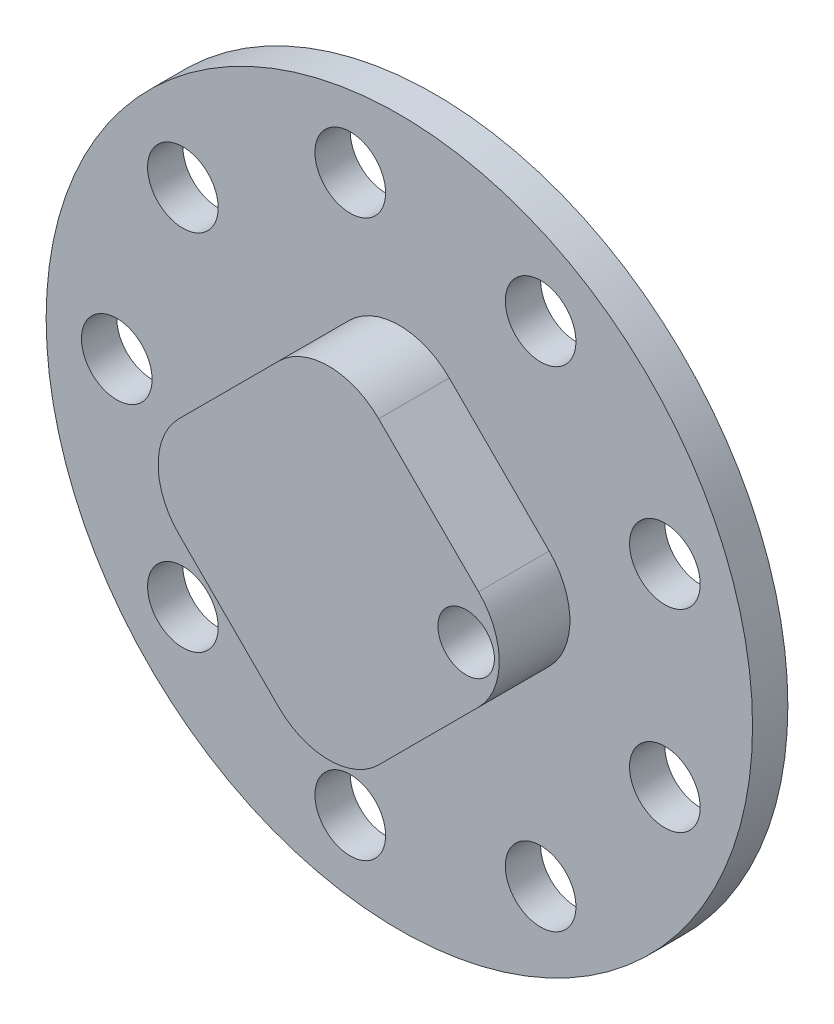
ISO-10303-21;
HEADER;
FILE_DESCRIPTION(('STEP AP214'),'2;1');
FILE_NAME('part.step','',(''),(''),'','','');
FILE_SCHEMA(('AUTOMOTIVE_DESIGN { 1 0 10303 214 1 1 1 1 }'));
ENDSEC;
DATA;
#1=APPLICATION_CONTEXT('core data for automotive mechanical design processes');
#2=APPLICATION_PROTOCOL_DEFINITION('international standard','automotive_design',2000,#1);
#3=PRODUCT_CONTEXT('',#1,'mechanical');
#4=PRODUCT('Part','Part','',(#3));
#5=PRODUCT_RELATED_PRODUCT_CATEGORY('part','',(#4));
#6=PRODUCT_DEFINITION_FORMATION('','',#4);
#7=PRODUCT_DEFINITION_CONTEXT('part definition',#1,'design');
#8=PRODUCT_DEFINITION('design','',#6,#7);
#9=PRODUCT_DEFINITION_SHAPE('','',#8);
#10=(LENGTH_UNIT() NAMED_UNIT(*) SI_UNIT(.MILLI.,.METRE.));
#11=(NAMED_UNIT(*) PLANE_ANGLE_UNIT() SI_UNIT($,.RADIAN.));
#12=(NAMED_UNIT(*) SI_UNIT($,.STERADIAN.) SOLID_ANGLE_UNIT());
#13=UNCERTAINTY_MEASURE_WITH_UNIT(LENGTH_MEASURE(1.E-05),#10,'distance_accuracy_value','');
#14=(GEOMETRIC_REPRESENTATION_CONTEXT(3) GLOBAL_UNCERTAINTY_ASSIGNED_CONTEXT((#13)) GLOBAL_UNIT_ASSIGNED_CONTEXT((#10,
#11,#12)) REPRESENTATION_CONTEXT('',''));
#15=CARTESIAN_POINT('',(0.,0.,0.));
#16=DIRECTION('',(0.,0.,1.));
#17=DIRECTION('',(1.,0.,0.));
#18=AXIS2_PLACEMENT_3D('',#15,#16,#17);
#19=CARTESIAN_POINT('',(0.,0.,5.));
#20=DIRECTION('',(0.,0.,1.));
#21=DIRECTION('',(1.,0.,0.));
#22=AXIS2_PLACEMENT_3D('',#19,#20,#21);
#23=PLANE('',#22);
#24=CARTESIAN_POINT('',(0.,0.,5.));
#25=DIRECTION('',(0.,0.,1.));
#26=DIRECTION('',(1.,0.,0.));
#27=AXIS2_PLACEMENT_3D('',#24,#25,#26);
#28=CIRCLE('',#27,50.);
#29=CARTESIAN_POINT('',(50.,0.,5.));
#30=VERTEX_POINT('',#29);
#31=EDGE_CURVE('E199',#30,#30,#28,.T.);
#32=ORIENTED_EDGE('',*,*,#31,.T.);
#33=EDGE_LOOP('',(#32));
#34=FACE_BOUND('',#33,.T.);
#35=CARTESIAN_POINT('',(-40.,0.,5.));
#36=DIRECTION('',(0.,0.,1.));
#37=DIRECTION('',(1.,0.,0.));
#38=AXIS2_PLACEMENT_3D('',#35,#36,#37);
#39=CIRCLE('',#38,5.);
#40=CARTESIAN_POINT('',(-35.,0.,5.));
#41=VERTEX_POINT('',#40);
#42=EDGE_CURVE('E190',#41,#41,#39,.T.);
#43=ORIENTED_EDGE('',*,*,#42,.F.);
#44=EDGE_LOOP('',(#43));
#45=FACE_BOUND('',#44,.T.);
#46=CARTESIAN_POINT('',(-30.6417777247591,25.7115043874616,5.));
#47=DIRECTION('',(0.,0.,1.));
#48=DIRECTION('',(0.766044443118977,-0.642787609686541,0.));
#49=AXIS2_PLACEMENT_3D('',#46,#47,#48);
#50=CIRCLE('',#49,5.);
#51=CARTESIAN_POINT('',(-26.8115555091642,22.4975663390289,5.));
#52=VERTEX_POINT('',#51);
#53=EDGE_CURVE('E184',#52,#52,#50,.T.);
#54=ORIENTED_EDGE('',*,*,#53,.F.);
#55=EDGE_LOOP('',(#54));
#56=FACE_BOUND('',#55,.T.);
#57=CARTESIAN_POINT('',(-6.94592710667709,39.3923101204883,5.));
#58=DIRECTION('',(0.,0.,1.));
#59=DIRECTION('',(0.173648177666927,-0.984807753012209,0.));
#60=AXIS2_PLACEMENT_3D('',#57,#58,#59);
#61=CIRCLE('',#60,5.);
#62=CARTESIAN_POINT('',(-6.07768621834246,34.4682713554273,5.));
#63=VERTEX_POINT('',#62);
#64=EDGE_CURVE('E178',#63,#63,#61,.T.);
#65=ORIENTED_EDGE('',*,*,#64,.F.);
#66=EDGE_LOOP('',(#65));
#67=FACE_BOUND('',#66,.T.);
#68=CARTESIAN_POINT('',(20.0000000000002,34.6410161513775,5.));
#69=DIRECTION('',(0.,0.,1.));
#70=DIRECTION('',(-0.500000000000004,-0.866025403784436,0.));
#71=AXIS2_PLACEMENT_3D('',#68,#69,#70);
#72=CIRCLE('',#71,5.);
#73=CARTESIAN_POINT('',(17.5000000000001,30.3108891324553,5.));
#74=VERTEX_POINT('',#73);
#75=EDGE_CURVE('E172',#74,#74,#72,.T.);
#76=ORIENTED_EDGE('',*,*,#75,.F.);
#77=EDGE_LOOP('',(#76));
#78=FACE_BOUND('',#77,.T.);
#79=CARTESIAN_POINT('',(37.5877048314364,13.6808057330265,5.));
#80=DIRECTION('',(0.,0.,1.));
#81=DIRECTION('',(-0.939692620785911,-0.342020143325663,0.));
#82=AXIS2_PLACEMENT_3D('',#79,#80,#81);
#83=CIRCLE('',#82,5.);
#84=CARTESIAN_POINT('',(32.8892417275069,11.9707050163982,5.));
#85=VERTEX_POINT('',#84);
#86=EDGE_CURVE('E166',#85,#85,#83,.T.);
#87=ORIENTED_EDGE('',*,*,#86,.F.);
#88=EDGE_LOOP('',(#87));
#89=FACE_BOUND('',#88,.T.);
#90=CARTESIAN_POINT('',(37.5877048314362,-13.680805733027,5.));
#91=DIRECTION('',(0.,0.,1.));
#92=DIRECTION('',(-0.939692620785906,0.342020143325676,0.));
#93=AXIS2_PLACEMENT_3D('',#90,#91,#92);
#94=CIRCLE('',#93,5.);
#95=CARTESIAN_POINT('',(32.8892417275067,-11.9707050163987,5.));
#96=VERTEX_POINT('',#95);
#97=EDGE_CURVE('E160',#96,#96,#94,.T.);
#98=ORIENTED_EDGE('',*,*,#97,.F.);
#99=EDGE_LOOP('',(#98));
#100=FACE_BOUND('',#99,.T.);
#101=CARTESIAN_POINT('',(19.9999999999997,-34.6410161513777,5.));
#102=DIRECTION('',(0.,0.,1.));
#103=DIRECTION('',(-0.499999999999992,0.866025403784443,0.));
#104=AXIS2_PLACEMENT_3D('',#101,#102,#103);
#105=CIRCLE('',#104,5.);
#106=CARTESIAN_POINT('',(17.4999999999997,-30.3108891324555,5.));
#107=VERTEX_POINT('',#106);
#108=EDGE_CURVE('E154',#107,#107,#105,.T.);
#109=ORIENTED_EDGE('',*,*,#108,.F.);
#110=EDGE_LOOP('',(#109));
#111=FACE_BOUND('',#110,.T.);
#112=CARTESIAN_POINT('',(-6.94592710667762,-39.3923101204883,5.));
#113=DIRECTION('',(0.,0.,1.));
#114=DIRECTION('',(0.17364817766694,0.984807753012206,0.));
#115=AXIS2_PLACEMENT_3D('',#112,#113,#114);
#116=CIRCLE('',#115,5.);
#117=CARTESIAN_POINT('',(-6.07768621834292,-34.4682713554272,5.));
#118=VERTEX_POINT('',#117);
#119=EDGE_CURVE('E148',#118,#118,#116,.T.);
#120=ORIENTED_EDGE('',*,*,#119,.F.);
#121=EDGE_LOOP('',(#120));
#122=FACE_BOUND('',#121,.T.);
#123=CARTESIAN_POINT('',(-30.6417777247594,-25.7115043874612,5.));
#124=DIRECTION('',(0.,0.,1.));
#125=DIRECTION('',(0.766044443118986,0.64278760968653,0.));
#126=AXIS2_PLACEMENT_3D('',#123,#124,#125);
#127=CIRCLE('',#126,5.);
#128=CARTESIAN_POINT('',(-26.8115555091645,-22.4975663390286,5.));
#129=VERTEX_POINT('',#128);
#130=EDGE_CURVE('E142',#129,#129,#127,.T.);
#131=ORIENTED_EDGE('',*,*,#130,.F.);
#132=EDGE_LOOP('',(#131));
#133=FACE_BOUND('',#132,.T.);
#134=DIRECTION('',(0.707106781186547,0.707106781186548,0.));
#135=VECTOR('',#134,1.);
#136=CARTESIAN_POINT('',(0.,-28.2842712474619,5.));
#137=LINE('',#136,#135);
#138=CARTESIAN_POINT('',(7.07106781186548,-21.2132034355964,5.));
#139=VERTEX_POINT('',#138);
#140=CARTESIAN_POINT('',(21.2132034355964,-7.07106781186548,5.));
#141=VERTEX_POINT('',#140);
#142=EDGE_CURVE('E118',#139,#141,#137,.T.);
#143=ORIENTED_EDGE('',*,*,#142,.F.);
#144=CARTESIAN_POINT('',(0.,-14.142135623731,5.));
#145=DIRECTION('',(0.,0.,1.));
#146=DIRECTION('',(1.,0.,0.));
#147=AXIS2_PLACEMENT_3D('',#144,#145,#146);
#148=CIRCLE('',#147,10.);
#149=CARTESIAN_POINT('',(-7.07106781186547,-21.2132034355964,5.));
#150=VERTEX_POINT('',#149);
#151=EDGE_CURVE('E103',#139,#150,#148,.F.);
#152=ORIENTED_EDGE('',*,*,#151,.T.);
#153=DIRECTION('',(0.707106781186547,-0.707106781186548,0.));
#154=VECTOR('',#153,1.);
#155=CARTESIAN_POINT('',(-28.2842712474619,0.,5.));
#156=LINE('',#155,#154);
#157=CARTESIAN_POINT('',(-21.2132034355964,-7.07106781186547,5.));
#158=VERTEX_POINT('',#157);
#159=EDGE_CURVE('E110',#158,#150,#156,.T.);
#160=ORIENTED_EDGE('',*,*,#159,.F.);
#161=CARTESIAN_POINT('',(-14.1421356237309,0.,5.));
#162=DIRECTION('',(0.,0.,1.));
#163=DIRECTION('',(1.,0.,0.));
#164=AXIS2_PLACEMENT_3D('',#161,#162,#163);
#165=CIRCLE('',#164,10.);
#166=CARTESIAN_POINT('',(-21.2132034355964,7.07106781186547,5.));
#167=VERTEX_POINT('',#166);
#168=EDGE_CURVE('E95',#158,#167,#165,.F.);
#169=ORIENTED_EDGE('',*,*,#168,.T.);
#170=DIRECTION('',(-0.707106781186547,-0.707106781186548,0.));
#171=VECTOR('',#170,1.);
#172=CARTESIAN_POINT('',(0.,28.2842712474619,5.));
#173=LINE('',#172,#171);
#174=CARTESIAN_POINT('',(-7.07106781186547,21.2132034355964,5.));
#175=VERTEX_POINT('',#174);
#176=EDGE_CURVE('E130',#175,#167,#173,.T.);
#177=ORIENTED_EDGE('',*,*,#176,.F.);
#178=CARTESIAN_POINT('',(0.,14.142135623731,5.));
#179=DIRECTION('',(0.,0.,1.));
#180=DIRECTION('',(1.,0.,0.));
#181=AXIS2_PLACEMENT_3D('',#178,#179,#180);
#182=CIRCLE('',#181,10.);
#183=CARTESIAN_POINT('',(7.07106781186548,21.2132034355964,5.));
#184=VERTEX_POINT('',#183);
#185=EDGE_CURVE('E11',#175,#184,#182,.F.);
#186=ORIENTED_EDGE('',*,*,#185,.T.);
#187=DIRECTION('',(-0.707106781186547,0.707106781186548,0.));
#188=VECTOR('',#187,1.);
#189=CARTESIAN_POINT('',(28.2842712474619,0.,5.));
#190=LINE('',#189,#188);
#191=CARTESIAN_POINT('',(21.2132034355964,7.07106781186547,5.));
#192=VERTEX_POINT('',#191);
#193=EDGE_CURVE('E122',#192,#184,#190,.T.);
#194=ORIENTED_EDGE('',*,*,#193,.F.);
#195=CARTESIAN_POINT('',(14.142135623731,0.,5.));
#196=DIRECTION('',(0.,0.,1.));
#197=DIRECTION('',(1.,0.,0.));
#198=AXIS2_PLACEMENT_3D('',#195,#196,#197);
#199=CIRCLE('',#198,10.);
#200=EDGE_CURVE('E39',#192,#141,#199,.F.);
#201=ORIENTED_EDGE('',*,*,#200,.T.);
#202=EDGE_LOOP('',(#143,#152,#160,#169,#177,#186,#194,#201));
#203=FACE_BOUND('',#202,.T.);
#204=ADVANCED_FACE('F31',(#34,#45,#56,#67,#78,#89,#100,#111,#122,#133,#203),#23,.T.);
#205=CARTESIAN_POINT('',(0.,0.,5.));
#206=DIRECTION('',(0.,0.,-1.));
#207=DIRECTION('',(-1.,0.,0.));
#208=AXIS2_PLACEMENT_3D('',#205,#206,#207);
#209=CYLINDRICAL_SURFACE('',#208,50.);
#210=ORIENTED_EDGE('',*,*,#31,.F.);
#211=EDGE_LOOP('',(#210));
#212=FACE_BOUND('',#211,.T.);
#213=CARTESIAN_POINT('',(0.,0.,0.));
#214=DIRECTION('',(0.,0.,1.));
#215=DIRECTION('',(1.,0.,0.));
#216=AXIS2_PLACEMENT_3D('',#213,#214,#215);
#217=CIRCLE('',#216,50.);
#218=CARTESIAN_POINT('',(50.,0.,0.));
#219=VERTEX_POINT('',#218);
#220=EDGE_CURVE('E196',#219,#219,#217,.T.);
#221=ORIENTED_EDGE('',*,*,#220,.T.);
#222=EDGE_LOOP('',(#221));
#223=FACE_BOUND('',#222,.T.);
#224=ADVANCED_FACE('F33',(#212,#223),#209,.T.);
#225=CARTESIAN_POINT('',(0.,0.,0.));
#226=DIRECTION('',(0.,0.,1.));
#227=DIRECTION('',(1.,0.,0.));
#228=AXIS2_PLACEMENT_3D('',#225,#226,#227);
#229=PLANE('',#228);
#230=CARTESIAN_POINT('',(19.4603538970775,0.,0.));
#231=DIRECTION('',(0.,0.,1.));
#232=DIRECTION('',(1.,0.,0.));
#233=AXIS2_PLACEMENT_3D('',#230,#231,#232);
#234=CIRCLE('',#233,4.);
#235=CARTESIAN_POINT('',(23.4603538970775,0.,0.));
#236=VERTEX_POINT('',#235);
#237=EDGE_CURVE('E119',#236,#236,#234,.F.);
#238=ORIENTED_EDGE('',*,*,#237,.F.);
#239=EDGE_LOOP('',(#238));
#240=FACE_BOUND('',#239,.T.);
#241=CARTESIAN_POINT('',(-30.6417777247594,-25.7115043874612,0.));
#242=DIRECTION('',(0.,0.,1.));
#243=DIRECTION('',(0.766044443118986,0.64278760968653,0.));
#244=AXIS2_PLACEMENT_3D('',#241,#242,#243);
#245=CIRCLE('',#244,5.);
#246=CARTESIAN_POINT('',(-26.8115555091645,-22.4975663390286,0.));
#247=VERTEX_POINT('',#246);
#248=EDGE_CURVE('E145',#247,#247,#245,.T.);
#249=ORIENTED_EDGE('',*,*,#248,.T.);
#250=EDGE_LOOP('',(#249));
#251=FACE_BOUND('',#250,.T.);
#252=CARTESIAN_POINT('',(-6.94592710667762,-39.3923101204883,0.));
#253=DIRECTION('',(0.,0.,1.));
#254=DIRECTION('',(0.17364817766694,0.984807753012206,0.));
#255=AXIS2_PLACEMENT_3D('',#252,#253,#254);
#256=CIRCLE('',#255,5.);
#257=CARTESIAN_POINT('',(-6.07768621834292,-34.4682713554272,0.));
#258=VERTEX_POINT('',#257);
#259=EDGE_CURVE('E151',#258,#258,#256,.T.);
#260=ORIENTED_EDGE('',*,*,#259,.T.);
#261=EDGE_LOOP('',(#260));
#262=FACE_BOUND('',#261,.T.);
#263=CARTESIAN_POINT('',(19.9999999999997,-34.6410161513777,0.));
#264=DIRECTION('',(0.,0.,1.));
#265=DIRECTION('',(-0.499999999999992,0.866025403784443,0.));
#266=AXIS2_PLACEMENT_3D('',#263,#264,#265);
#267=CIRCLE('',#266,5.);
#268=CARTESIAN_POINT('',(17.4999999999997,-30.3108891324555,0.));
#269=VERTEX_POINT('',#268);
#270=EDGE_CURVE('E157',#269,#269,#267,.T.);
#271=ORIENTED_EDGE('',*,*,#270,.T.);
#272=EDGE_LOOP('',(#271));
#273=FACE_BOUND('',#272,.T.);
#274=CARTESIAN_POINT('',(37.5877048314362,-13.680805733027,0.));
#275=DIRECTION('',(0.,0.,1.));
#276=DIRECTION('',(-0.939692620785906,0.342020143325676,0.));
#277=AXIS2_PLACEMENT_3D('',#274,#275,#276);
#278=CIRCLE('',#277,5.);
#279=CARTESIAN_POINT('',(32.8892417275067,-11.9707050163987,0.));
#280=VERTEX_POINT('',#279);
#281=EDGE_CURVE('E163',#280,#280,#278,.T.);
#282=ORIENTED_EDGE('',*,*,#281,.T.);
#283=EDGE_LOOP('',(#282));
#284=FACE_BOUND('',#283,.T.);
#285=CARTESIAN_POINT('',(37.5877048314364,13.6808057330265,0.));
#286=DIRECTION('',(0.,0.,1.));
#287=DIRECTION('',(-0.939692620785911,-0.342020143325663,0.));
#288=AXIS2_PLACEMENT_3D('',#285,#286,#287);
#289=CIRCLE('',#288,5.);
#290=CARTESIAN_POINT('',(32.8892417275069,11.9707050163982,0.));
#291=VERTEX_POINT('',#290);
#292=EDGE_CURVE('E169',#291,#291,#289,.T.);
#293=ORIENTED_EDGE('',*,*,#292,.T.);
#294=EDGE_LOOP('',(#293));
#295=FACE_BOUND('',#294,.T.);
#296=CARTESIAN_POINT('',(20.0000000000002,34.6410161513775,0.));
#297=DIRECTION('',(0.,0.,1.));
#298=DIRECTION('',(-0.500000000000004,-0.866025403784436,0.));
#299=AXIS2_PLACEMENT_3D('',#296,#297,#298);
#300=CIRCLE('',#299,5.);
#301=CARTESIAN_POINT('',(17.5000000000001,30.3108891324553,0.));
#302=VERTEX_POINT('',#301);
#303=EDGE_CURVE('E175',#302,#302,#300,.T.);
#304=ORIENTED_EDGE('',*,*,#303,.T.);
#305=EDGE_LOOP('',(#304));
#306=FACE_BOUND('',#305,.T.);
#307=CARTESIAN_POINT('',(-6.94592710667709,39.3923101204883,0.));
#308=DIRECTION('',(0.,0.,1.));
#309=DIRECTION('',(0.173648177666927,-0.984807753012209,0.));
#310=AXIS2_PLACEMENT_3D('',#307,#308,#309);
#311=CIRCLE('',#310,5.);
#312=CARTESIAN_POINT('',(-6.07768621834246,34.4682713554273,0.));
#313=VERTEX_POINT('',#312);
#314=EDGE_CURVE('E181',#313,#313,#311,.T.);
#315=ORIENTED_EDGE('',*,*,#314,.T.);
#316=EDGE_LOOP('',(#315));
#317=FACE_BOUND('',#316,.T.);
#318=CARTESIAN_POINT('',(-30.6417777247591,25.7115043874616,0.));
#319=DIRECTION('',(0.,0.,1.));
#320=DIRECTION('',(0.766044443118977,-0.642787609686541,0.));
#321=AXIS2_PLACEMENT_3D('',#318,#319,#320);
#322=CIRCLE('',#321,5.);
#323=CARTESIAN_POINT('',(-26.8115555091642,22.4975663390289,0.));
#324=VERTEX_POINT('',#323);
#325=EDGE_CURVE('E187',#324,#324,#322,.T.);
#326=ORIENTED_EDGE('',*,*,#325,.T.);
#327=EDGE_LOOP('',(#326));
#328=FACE_BOUND('',#327,.T.);
#329=CARTESIAN_POINT('',(-40.,0.,0.));
#330=DIRECTION('',(0.,0.,1.));
#331=DIRECTION('',(1.,0.,0.));
#332=AXIS2_PLACEMENT_3D('',#329,#330,#331);
#333=CIRCLE('',#332,5.);
#334=CARTESIAN_POINT('',(-35.,0.,0.));
#335=VERTEX_POINT('',#334);
#336=EDGE_CURVE('E193',#335,#335,#333,.T.);
#337=ORIENTED_EDGE('',*,*,#336,.T.);
#338=EDGE_LOOP('',(#337));
#339=FACE_BOUND('',#338,.T.);
#340=ORIENTED_EDGE('',*,*,#220,.F.);
#341=EDGE_LOOP('',(#340));
#342=FACE_BOUND('',#341,.T.);
#343=ADVANCED_FACE('F255',(#240,#251,#262,#273,#284,#295,#306,#317,#328,#339,#342),#229,.F.);
#344=CARTESIAN_POINT('',(-40.,0.,0.));
#345=DIRECTION('',(0.,0.,1.));
#346=DIRECTION('',(1.,0.,0.));
#347=AXIS2_PLACEMENT_3D('',#344,#345,#346);
#348=CYLINDRICAL_SURFACE('',#347,5.);
#349=ORIENTED_EDGE('',*,*,#336,.F.);
#350=EDGE_LOOP('',(#349));
#351=FACE_BOUND('',#350,.T.);
#352=ORIENTED_EDGE('',*,*,#42,.T.);
#353=EDGE_LOOP('',(#352));
#354=FACE_BOUND('',#353,.T.);
#355=ADVANCED_FACE('F261',(#351,#354),#348,.F.);
#356=CARTESIAN_POINT('',(-30.6417777247591,25.7115043874616,0.));
#357=DIRECTION('',(0.,0.,1.));
#358=DIRECTION('',(1.,0.,0.));
#359=AXIS2_PLACEMENT_3D('',#356,#357,#358);
#360=CYLINDRICAL_SURFACE('',#359,5.);
#361=ORIENTED_EDGE('',*,*,#325,.F.);
#362=EDGE_LOOP('',(#361));
#363=FACE_BOUND('',#362,.T.);
#364=ORIENTED_EDGE('',*,*,#53,.T.);
#365=EDGE_LOOP('',(#364));
#366=FACE_BOUND('',#365,.T.);
#367=ADVANCED_FACE('F265',(#363,#366),#360,.F.);
#368=CARTESIAN_POINT('',(-6.94592710667709,39.3923101204883,0.));
#369=DIRECTION('',(0.,0.,1.));
#370=DIRECTION('',(1.,0.,0.));
#371=AXIS2_PLACEMENT_3D('',#368,#369,#370);
#372=CYLINDRICAL_SURFACE('',#371,5.);
#373=ORIENTED_EDGE('',*,*,#314,.F.);
#374=EDGE_LOOP('',(#373));
#375=FACE_BOUND('',#374,.T.);
#376=ORIENTED_EDGE('',*,*,#64,.T.);
#377=EDGE_LOOP('',(#376));
#378=FACE_BOUND('',#377,.T.);
#379=ADVANCED_FACE('F269',(#375,#378),#372,.F.);
#380=CARTESIAN_POINT('',(20.0000000000002,34.6410161513775,0.));
#381=DIRECTION('',(0.,0.,1.));
#382=DIRECTION('',(1.,0.,0.));
#383=AXIS2_PLACEMENT_3D('',#380,#381,#382);
#384=CYLINDRICAL_SURFACE('',#383,5.);
#385=ORIENTED_EDGE('',*,*,#303,.F.);
#386=EDGE_LOOP('',(#385));
#387=FACE_BOUND('',#386,.T.);
#388=ORIENTED_EDGE('',*,*,#75,.T.);
#389=EDGE_LOOP('',(#388));
#390=FACE_BOUND('',#389,.T.);
#391=ADVANCED_FACE('F273',(#387,#390),#384,.F.);
#392=CARTESIAN_POINT('',(37.5877048314364,13.6808057330265,0.));
#393=DIRECTION('',(0.,0.,1.));
#394=DIRECTION('',(1.,0.,0.));
#395=AXIS2_PLACEMENT_3D('',#392,#393,#394);
#396=CYLINDRICAL_SURFACE('',#395,5.);
#397=ORIENTED_EDGE('',*,*,#292,.F.);
#398=EDGE_LOOP('',(#397));
#399=FACE_BOUND('',#398,.T.);
#400=ORIENTED_EDGE('',*,*,#86,.T.);
#401=EDGE_LOOP('',(#400));
#402=FACE_BOUND('',#401,.T.);
#403=ADVANCED_FACE('F277',(#399,#402),#396,.F.);
#404=CARTESIAN_POINT('',(37.5877048314362,-13.680805733027,0.));
#405=DIRECTION('',(0.,0.,1.));
#406=DIRECTION('',(1.,0.,0.));
#407=AXIS2_PLACEMENT_3D('',#404,#405,#406);
#408=CYLINDRICAL_SURFACE('',#407,5.);
#409=ORIENTED_EDGE('',*,*,#281,.F.);
#410=EDGE_LOOP('',(#409));
#411=FACE_BOUND('',#410,.T.);
#412=ORIENTED_EDGE('',*,*,#97,.T.);
#413=EDGE_LOOP('',(#412));
#414=FACE_BOUND('',#413,.T.);
#415=ADVANCED_FACE('F281',(#411,#414),#408,.F.);
#416=CARTESIAN_POINT('',(19.9999999999997,-34.6410161513777,0.));
#417=DIRECTION('',(0.,0.,1.));
#418=DIRECTION('',(1.,0.,0.));
#419=AXIS2_PLACEMENT_3D('',#416,#417,#418);
#420=CYLINDRICAL_SURFACE('',#419,5.);
#421=ORIENTED_EDGE('',*,*,#270,.F.);
#422=EDGE_LOOP('',(#421));
#423=FACE_BOUND('',#422,.T.);
#424=ORIENTED_EDGE('',*,*,#108,.T.);
#425=EDGE_LOOP('',(#424));
#426=FACE_BOUND('',#425,.T.);
#427=ADVANCED_FACE('F285',(#423,#426),#420,.F.);
#428=CARTESIAN_POINT('',(-6.94592710667762,-39.3923101204883,0.));
#429=DIRECTION('',(0.,0.,1.));
#430=DIRECTION('',(1.,0.,0.));
#431=AXIS2_PLACEMENT_3D('',#428,#429,#430);
#432=CYLINDRICAL_SURFACE('',#431,5.);
#433=ORIENTED_EDGE('',*,*,#259,.F.);
#434=EDGE_LOOP('',(#433));
#435=FACE_BOUND('',#434,.T.);
#436=ORIENTED_EDGE('',*,*,#119,.T.);
#437=EDGE_LOOP('',(#436));
#438=FACE_BOUND('',#437,.T.);
#439=ADVANCED_FACE('F289',(#435,#438),#432,.F.);
#440=CARTESIAN_POINT('',(-30.6417777247594,-25.7115043874612,0.));
#441=DIRECTION('',(0.,0.,1.));
#442=DIRECTION('',(1.,0.,0.));
#443=AXIS2_PLACEMENT_3D('',#440,#441,#442);
#444=CYLINDRICAL_SURFACE('',#443,5.);
#445=ORIENTED_EDGE('',*,*,#248,.F.);
#446=EDGE_LOOP('',(#445));
#447=FACE_BOUND('',#446,.T.);
#448=ORIENTED_EDGE('',*,*,#130,.T.);
#449=EDGE_LOOP('',(#448));
#450=FACE_BOUND('',#449,.T.);
#451=ADVANCED_FACE('F293',(#447,#450),#444,.F.);
#452=CARTESIAN_POINT('',(-28.2842712474619,0.,15.));
#453=DIRECTION('',(0.707106781186548,0.707106781186547,0.));
#454=DIRECTION('',(-0.707106781186547,0.707106781186548,0.));
#455=AXIS2_PLACEMENT_3D('',#452,#453,#454);
#456=PLANE('',#455);
#457=DIRECTION('',(0.707106781186547,-0.707106781186548,0.));
#458=VECTOR('',#457,1.);
#459=CARTESIAN_POINT('',(-28.2842712474619,0.,15.));
#460=LINE('',#459,#458);
#461=CARTESIAN_POINT('',(-21.2132034355964,-7.07106781186547,15.));
#462=VERTEX_POINT('',#461);
#463=CARTESIAN_POINT('',(-7.07106781186547,-21.2132034355964,15.));
#464=VERTEX_POINT('',#463);
#465=EDGE_CURVE('E113',#462,#464,#460,.T.);
#466=ORIENTED_EDGE('',*,*,#465,.F.);
#467=DIRECTION('',(0.,0.,-1.));
#468=VECTOR('',#467,1.);
#469=CARTESIAN_POINT('',(-21.2132034355964,-7.07106781186548,15.));
#470=LINE('',#469,#468);
#471=EDGE_CURVE('E99',#462,#158,#470,.T.);
#472=ORIENTED_EDGE('',*,*,#471,.T.);
#473=ORIENTED_EDGE('',*,*,#159,.T.);
#474=DIRECTION('',(0.,0.,-1.));
#475=VECTOR('',#474,1.);
#476=CARTESIAN_POINT('',(-7.07106781186547,-21.2132034355964,15.));
#477=LINE('',#476,#475);
#478=EDGE_CURVE('E115',#150,#464,#477,.F.);
#479=ORIENTED_EDGE('',*,*,#478,.T.);
#480=EDGE_LOOP('',(#466,#472,#473,#479));
#481=FACE_BOUND('',#480,.T.);
#482=ADVANCED_FACE('F109',(#481),#456,.F.);
#483=CARTESIAN_POINT('',(0.,-28.2842712474619,15.));
#484=DIRECTION('',(-0.707106781186548,0.707106781186547,0.));
#485=DIRECTION('',(-0.707106781186547,-0.707106781186548,0.));
#486=AXIS2_PLACEMENT_3D('',#483,#484,#485);
#487=PLANE('',#486);
#488=DIRECTION('',(0.707106781186547,0.707106781186548,0.));
#489=VECTOR('',#488,1.);
#490=CARTESIAN_POINT('',(0.,-28.2842712474619,15.));
#491=LINE('',#490,#489);
#492=CARTESIAN_POINT('',(7.07106781186548,-21.2132034355964,15.));
#493=VERTEX_POINT('',#492);
#494=CARTESIAN_POINT('',(21.2132034355964,-7.07106781186548,15.));
#495=VERTEX_POINT('',#494);
#496=EDGE_CURVE('E133',#493,#495,#491,.T.);
#497=ORIENTED_EDGE('',*,*,#496,.F.);
#498=DIRECTION('',(0.,0.,-1.));
#499=VECTOR('',#498,1.);
#500=CARTESIAN_POINT('',(7.07106781186548,-21.2132034355964,15.));
#501=LINE('',#500,#499);
#502=EDGE_CURVE('E216',#493,#139,#501,.T.);
#503=ORIENTED_EDGE('',*,*,#502,.T.);
#504=ORIENTED_EDGE('',*,*,#142,.T.);
#505=DIRECTION('',(0.,0.,-1.));
#506=VECTOR('',#505,1.);
#507=CARTESIAN_POINT('',(21.2132034355964,-7.07106781186547,15.));
#508=LINE('',#507,#506);
#509=EDGE_CURVE('E214',#141,#495,#508,.F.);
#510=ORIENTED_EDGE('',*,*,#509,.T.);
#511=EDGE_LOOP('',(#497,#503,#504,#510));
#512=FACE_BOUND('',#511,.T.);
#513=ADVANCED_FACE('F224',(#512),#487,.F.);
#514=CARTESIAN_POINT('',(28.2842712474619,0.,15.));
#515=DIRECTION('',(-0.707106781186548,-0.707106781186547,0.));
#516=DIRECTION('',(0.707106781186547,-0.707106781186548,0.));
#517=AXIS2_PLACEMENT_3D('',#514,#515,#516);
#518=PLANE('',#517);
#519=DIRECTION('',(-0.707106781186547,0.707106781186548,0.));
#520=VECTOR('',#519,1.);
#521=CARTESIAN_POINT('',(28.2842712474619,0.,15.));
#522=LINE('',#521,#520);
#523=CARTESIAN_POINT('',(21.2132034355964,7.07106781186547,15.));
#524=VERTEX_POINT('',#523);
#525=CARTESIAN_POINT('',(7.07106781186548,21.2132034355964,15.));
#526=VERTEX_POINT('',#525);
#527=EDGE_CURVE('E136',#524,#526,#522,.T.);
#528=ORIENTED_EDGE('',*,*,#527,.F.);
#529=DIRECTION('',(0.,0.,-1.));
#530=VECTOR('',#529,1.);
#531=CARTESIAN_POINT('',(21.2132034355964,7.07106781186547,15.));
#532=LINE('',#531,#530);
#533=EDGE_CURVE('E104',#524,#192,#532,.T.);
#534=ORIENTED_EDGE('',*,*,#533,.T.);
#535=ORIENTED_EDGE('',*,*,#193,.T.);
#536=DIRECTION('',(0.,0.,-1.));
#537=VECTOR('',#536,1.);
#538=CARTESIAN_POINT('',(7.07106781186548,21.2132034355964,15.));
#539=LINE('',#538,#537);
#540=EDGE_CURVE('E219',#184,#526,#539,.F.);
#541=ORIENTED_EDGE('',*,*,#540,.T.);
#542=EDGE_LOOP('',(#528,#534,#535,#541));
#543=FACE_BOUND('',#542,.T.);
#544=ADVANCED_FACE('F233',(#543),#518,.F.);
#545=CARTESIAN_POINT('',(0.,28.2842712474619,15.));
#546=DIRECTION('',(0.707106781186548,-0.707106781186547,0.));
#547=DIRECTION('',(0.707106781186547,0.707106781186548,0.));
#548=AXIS2_PLACEMENT_3D('',#545,#546,#547);
#549=PLANE('',#548);
#550=ORIENTED_EDGE('',*,*,#176,.T.);
#551=DIRECTION('',(0.,0.,-1.));
#552=VECTOR('',#551,1.);
#553=CARTESIAN_POINT('',(-21.2132034355964,7.07106781186547,15.));
#554=LINE('',#553,#552);
#555=CARTESIAN_POINT('',(-21.2132034355964,7.07106781186547,15.));
#556=VERTEX_POINT('',#555);
#557=EDGE_CURVE('E100',#167,#556,#554,.F.);
#558=ORIENTED_EDGE('',*,*,#557,.T.);
#559=DIRECTION('',(-0.707106781186547,-0.707106781186548,0.));
#560=VECTOR('',#559,1.);
#561=CARTESIAN_POINT('',(0.,28.2842712474619,15.));
#562=LINE('',#561,#560);
#563=CARTESIAN_POINT('',(-7.07106781186547,21.2132034355964,15.));
#564=VERTEX_POINT('',#563);
#565=EDGE_CURVE('E139',#564,#556,#562,.T.);
#566=ORIENTED_EDGE('',*,*,#565,.F.);
#567=DIRECTION('',(0.,0.,-1.));
#568=VECTOR('',#567,1.);
#569=CARTESIAN_POINT('',(-7.07106781186547,21.2132034355964,15.));
#570=LINE('',#569,#568);
#571=EDGE_CURVE('E114',#564,#175,#570,.T.);
#572=ORIENTED_EDGE('',*,*,#571,.T.);
#573=EDGE_LOOP('',(#550,#558,#566,#572));
#574=FACE_BOUND('',#573,.T.);
#575=ADVANCED_FACE('F240',(#574),#549,.F.);
#576=CARTESIAN_POINT('',(0.,-28.2842712474619,15.));
#577=DIRECTION('',(0.,0.,1.));
#578=DIRECTION('',(1.,0.,0.));
#579=AXIS2_PLACEMENT_3D('',#576,#577,#578);
#580=PLANE('',#579);
#581=CARTESIAN_POINT('',(19.4603538970775,0.,15.));
#582=DIRECTION('',(0.,0.,1.));
#583=DIRECTION('',(1.,0.,0.));
#584=AXIS2_PLACEMENT_3D('',#581,#582,#583);
#585=CIRCLE('',#584,4.);
#586=CARTESIAN_POINT('',(23.4603538970775,0.,15.));
#587=VERTEX_POINT('',#586);
#588=EDGE_CURVE('E125',#587,#587,#585,.T.);
#589=ORIENTED_EDGE('',*,*,#588,.F.);
#590=EDGE_LOOP('',(#589));
#591=FACE_BOUND('',#590,.T.);
#592=ORIENTED_EDGE('',*,*,#565,.T.);
#593=CARTESIAN_POINT('',(-14.1421356237309,0.,15.));
#594=DIRECTION('',(0.,0.,1.));
#595=DIRECTION('',(1.,0.,0.));
#596=AXIS2_PLACEMENT_3D('',#593,#594,#595);
#597=CIRCLE('',#596,10.);
#598=EDGE_CURVE('E212',#556,#462,#597,.T.);
#599=ORIENTED_EDGE('',*,*,#598,.T.);
#600=ORIENTED_EDGE('',*,*,#465,.T.);
#601=CARTESIAN_POINT('',(0.,-14.142135623731,15.));
#602=DIRECTION('',(0.,0.,1.));
#603=DIRECTION('',(1.,0.,0.));
#604=AXIS2_PLACEMENT_3D('',#601,#602,#603);
#605=CIRCLE('',#604,10.);
#606=EDGE_CURVE('E210',#464,#493,#605,.T.);
#607=ORIENTED_EDGE('',*,*,#606,.T.);
#608=ORIENTED_EDGE('',*,*,#496,.T.);
#609=CARTESIAN_POINT('',(14.142135623731,0.,15.));
#610=DIRECTION('',(0.,0.,1.));
#611=DIRECTION('',(1.,0.,0.));
#612=AXIS2_PLACEMENT_3D('',#609,#610,#611);
#613=CIRCLE('',#612,10.);
#614=EDGE_CURVE('E208',#495,#524,#613,.T.);
#615=ORIENTED_EDGE('',*,*,#614,.T.);
#616=ORIENTED_EDGE('',*,*,#527,.T.);
#617=CARTESIAN_POINT('',(0.,14.142135623731,15.));
#618=DIRECTION('',(0.,0.,1.));
#619=DIRECTION('',(1.,0.,0.));
#620=AXIS2_PLACEMENT_3D('',#617,#618,#619);
#621=CIRCLE('',#620,10.);
#622=EDGE_CURVE('E206',#526,#564,#621,.T.);
#623=ORIENTED_EDGE('',*,*,#622,.T.);
#624=EDGE_LOOP('',(#592,#599,#600,#607,#608,#615,#616,#623));
#625=FACE_BOUND('',#624,.T.);
#626=ADVANCED_FACE('F230',(#591,#625),#580,.T.);
#627=CARTESIAN_POINT('',(-14.1421356237309,0.,15.));
#628=DIRECTION('',(0.,0.,-1.));
#629=DIRECTION('',(-1.,0.,0.));
#630=AXIS2_PLACEMENT_3D('',#627,#628,#629);
#631=CYLINDRICAL_SURFACE('',#630,10.);
#632=ORIENTED_EDGE('',*,*,#598,.F.);
#633=ORIENTED_EDGE('',*,*,#557,.F.);
#634=ORIENTED_EDGE('',*,*,#168,.F.);
#635=ORIENTED_EDGE('',*,*,#471,.F.);
#636=EDGE_LOOP('',(#632,#633,#634,#635));
#637=FACE_BOUND('',#636,.T.);
#638=ADVANCED_FACE('F98',(#637),#631,.T.);
#639=CARTESIAN_POINT('',(0.,-14.142135623731,15.));
#640=DIRECTION('',(0.,0.,-1.));
#641=DIRECTION('',(-1.,0.,0.));
#642=AXIS2_PLACEMENT_3D('',#639,#640,#641);
#643=CYLINDRICAL_SURFACE('',#642,10.);
#644=ORIENTED_EDGE('',*,*,#606,.F.);
#645=ORIENTED_EDGE('',*,*,#478,.F.);
#646=ORIENTED_EDGE('',*,*,#151,.F.);
#647=ORIENTED_EDGE('',*,*,#502,.F.);
#648=EDGE_LOOP('',(#644,#645,#646,#647));
#649=FACE_BOUND('',#648,.T.);
#650=ADVANCED_FACE('F323',(#649),#643,.T.);
#651=CARTESIAN_POINT('',(14.142135623731,0.,15.));
#652=DIRECTION('',(0.,0.,-1.));
#653=DIRECTION('',(-1.,0.,0.));
#654=AXIS2_PLACEMENT_3D('',#651,#652,#653);
#655=CYLINDRICAL_SURFACE('',#654,10.);
#656=ORIENTED_EDGE('',*,*,#614,.F.);
#657=ORIENTED_EDGE('',*,*,#509,.F.);
#658=ORIENTED_EDGE('',*,*,#200,.F.);
#659=ORIENTED_EDGE('',*,*,#533,.F.);
#660=EDGE_LOOP('',(#656,#657,#658,#659));
#661=FACE_BOUND('',#660,.T.);
#662=ADVANCED_FACE('F227',(#661),#655,.T.);
#663=CARTESIAN_POINT('',(0.,14.142135623731,15.));
#664=DIRECTION('',(0.,0.,-1.));
#665=DIRECTION('',(-1.,0.,0.));
#666=AXIS2_PLACEMENT_3D('',#663,#664,#665);
#667=CYLINDRICAL_SURFACE('',#666,10.);
#668=ORIENTED_EDGE('',*,*,#622,.F.);
#669=ORIENTED_EDGE('',*,*,#540,.F.);
#670=ORIENTED_EDGE('',*,*,#185,.F.);
#671=ORIENTED_EDGE('',*,*,#571,.F.);
#672=EDGE_LOOP('',(#668,#669,#670,#671));
#673=FACE_BOUND('',#672,.T.);
#674=ADVANCED_FACE('F236',(#673),#667,.T.);
#675=CARTESIAN_POINT('',(19.4603538970775,0.,-0.000999999999999265));
#676=DIRECTION('',(0.,0.,1.));
#677=DIRECTION('',(1.,0.,0.));
#678=AXIS2_PLACEMENT_3D('',#675,#676,#677);
#679=CYLINDRICAL_SURFACE('',#678,4.);
#680=ORIENTED_EDGE('',*,*,#588,.T.);
#681=EDGE_LOOP('',(#680));
#682=FACE_BOUND('',#681,.T.);
#683=ORIENTED_EDGE('',*,*,#237,.T.);
#684=EDGE_LOOP('',(#683));
#685=FACE_BOUND('',#684,.T.);
#686=ADVANCED_FACE('F349',(#682,#685),#679,.F.);
#687=CLOSED_SHELL('',(#204,#224,#343,#355,#367,#379,#391,#403,#415,#427,#439,#451,#482,#513,
#544,#575,#626,#638,#650,#662,#674,#686));
#688=MANIFOLD_SOLID_BREP('B2',#687);
#689=ADVANCED_BREP_SHAPE_REPRESENTATION('',(#18,#688),#14);
#690=SHAPE_DEFINITION_REPRESENTATION(#9,#689);
ENDSEC;
END-ISO-10303-21;
